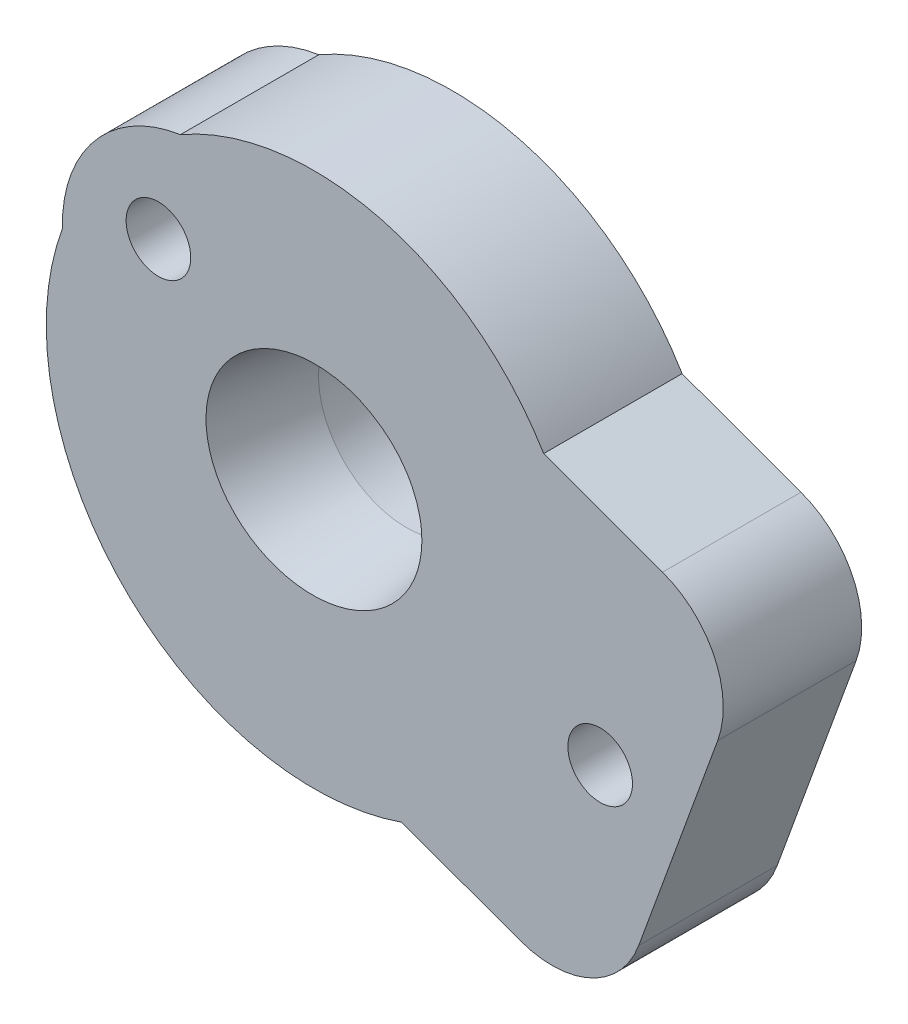
ISO-10303-21;
HEADER;
FILE_DESCRIPTION(('STEP AP214'),'2;1');
FILE_NAME('part.step','',(''),(''),'','','');
FILE_SCHEMA(('AUTOMOTIVE_DESIGN { 1 0 10303 214 1 1 1 1 }'));
ENDSEC;
DATA;
#1=APPLICATION_CONTEXT('core data for automotive mechanical design processes');
#2=APPLICATION_PROTOCOL_DEFINITION('international standard','automotive_design',2000,#1);
#3=PRODUCT_CONTEXT('',#1,'mechanical');
#4=PRODUCT('Part','Part','',(#3));
#5=PRODUCT_RELATED_PRODUCT_CATEGORY('part','',(#4));
#6=PRODUCT_DEFINITION_FORMATION('','',#4);
#7=PRODUCT_DEFINITION_CONTEXT('part definition',#1,'design');
#8=PRODUCT_DEFINITION('design','',#6,#7);
#9=PRODUCT_DEFINITION_SHAPE('','',#8);
#10=(LENGTH_UNIT() NAMED_UNIT(*) SI_UNIT(.MILLI.,.METRE.));
#11=(NAMED_UNIT(*) PLANE_ANGLE_UNIT() SI_UNIT($,.RADIAN.));
#12=(NAMED_UNIT(*) SI_UNIT($,.STERADIAN.) SOLID_ANGLE_UNIT());
#13=UNCERTAINTY_MEASURE_WITH_UNIT(LENGTH_MEASURE(1.E-05),#10,'distance_accuracy_value','');
#14=(GEOMETRIC_REPRESENTATION_CONTEXT(3) GLOBAL_UNCERTAINTY_ASSIGNED_CONTEXT((#13)) GLOBAL_UNIT_ASSIGNED_CONTEXT((#10,
#11,#12)) REPRESENTATION_CONTEXT('',''));
#15=CARTESIAN_POINT('',(0.,0.,0.));
#16=DIRECTION('',(0.,0.,1.));
#17=DIRECTION('',(1.,0.,0.));
#18=AXIS2_PLACEMENT_3D('',#15,#16,#17);
#19=CARTESIAN_POINT('',(0.,0.,10.));
#20=DIRECTION('',(0.,0.,-1.));
#21=DIRECTION('',(-1.,0.,0.));
#22=AXIS2_PLACEMENT_3D('',#19,#20,#21);
#23=CYLINDRICAL_SURFACE('',#22,29.);
#24=CARTESIAN_POINT('',(0.,0.,10.));
#25=DIRECTION('',(0.,0.,1.));
#26=DIRECTION('',(1.,0.,0.));
#27=AXIS2_PLACEMENT_3D('',#24,#25,#26);
#28=CIRCLE('',#27,29.);
#29=CARTESIAN_POINT('',(-27.2510860027963,9.91858415643088,10.));
#30=VERTEX_POINT('',#29);
#31=CARTESIAN_POINT('',(9.4973269071652,-27.4007441800115,10.));
#32=VERTEX_POINT('',#31);
#33=EDGE_CURVE('E153',#30,#32,#28,.T.);
#34=ORIENTED_EDGE('',*,*,#33,.F.);
#35=DIRECTION('',(0.,0.,1.));
#36=VECTOR('',#35,1.);
#37=CARTESIAN_POINT('',(-27.2510860027963,9.91858415643088,-5.));
#38=LINE('',#37,#36);
#39=CARTESIAN_POINT('',(-27.2510860027963,9.91858415643088,-5.));
#40=VERTEX_POINT('',#39);
#41=EDGE_CURVE('E211',#40,#30,#38,.T.);
#42=ORIENTED_EDGE('',*,*,#41,.F.);
#43=CARTESIAN_POINT('',(0.,0.,-5.));
#44=DIRECTION('',(0.,0.,1.));
#45=DIRECTION('',(1.,0.,0.));
#46=AXIS2_PLACEMENT_3D('',#43,#44,#45);
#47=CIRCLE('',#46,29.);
#48=CARTESIAN_POINT('',(9.4973269071652,-27.4007441800115,-5.));
#49=VERTEX_POINT('',#48);
#50=EDGE_CURVE('E222',#40,#49,#47,.T.);
#51=ORIENTED_EDGE('',*,*,#50,.T.);
#52=DIRECTION('',(0.,0.,-1.));
#53=VECTOR('',#52,1.);
#54=CARTESIAN_POINT('',(9.49732690716522,-27.4007441800115,10.));
#55=LINE('',#54,#53);
#56=EDGE_CURVE('E236',#49,#32,#55,.F.);
#57=ORIENTED_EDGE('',*,*,#56,.T.);
#58=EDGE_LOOP('',(#34,#42,#51,#57));
#59=FACE_BOUND('',#58,.T.);
#60=ADVANCED_FACE('F143',(#59),#23,.T.);
#61=CARTESIAN_POINT('',(24.88823335682,14.8854237553544,-5.));
#62=VERTEX_POINT('',#61);
#63=CARTESIAN_POINT('',(-14.4705437140708,25.1317202876995,-5.));
#64=VERTEX_POINT('',#63);
#65=EDGE_CURVE('E231',#62,#64,#47,.T.);
#66=ORIENTED_EDGE('',*,*,#65,.T.);
#67=DIRECTION('',(0.,0.,1.));
#68=VECTOR('',#67,1.);
#69=CARTESIAN_POINT('',(-14.4705437140708,25.1317202876995,-5.));
#70=LINE('',#69,#68);
#71=CARTESIAN_POINT('',(-14.4705437140708,25.1317202876995,10.));
#72=VERTEX_POINT('',#71);
#73=EDGE_CURVE('E214',#64,#72,#70,.T.);
#74=ORIENTED_EDGE('',*,*,#73,.T.);
#75=CARTESIAN_POINT('',(24.88823335682,14.8854237553545,10.));
#76=VERTEX_POINT('',#75);
#77=EDGE_CURVE('E13',#76,#72,#28,.T.);
#78=ORIENTED_EDGE('',*,*,#77,.F.);
#79=DIRECTION('',(0.,0.,-1.));
#80=VECTOR('',#79,1.);
#81=CARTESIAN_POINT('',(24.88823335682,14.8854237553544,10.));
#82=LINE('',#81,#80);
#83=EDGE_CURVE('E309',#62,#76,#82,.F.);
#84=ORIENTED_EDGE('',*,*,#83,.F.);
#85=EDGE_LOOP('',(#66,#74,#78,#84));
#86=FACE_BOUND('',#85,.T.);
#87=ADVANCED_FACE('F145',(#86),#23,.T.);
#88=CARTESIAN_POINT('',(0.,0.,10.));
#89=DIRECTION('',(0.,0.,1.));
#90=DIRECTION('',(1.,0.,0.));
#91=AXIS2_PLACEMENT_3D('',#88,#89,#90);
#92=PLANE('',#91);
#93=ORIENTED_EDGE('',*,*,#77,.T.);
#94=CARTESIAN_POINT('',(-12.2352670019781,10.2788370513048,10.));
#95=DIRECTION('',(0.,0.,1.));
#96=DIRECTION('',(1.,0.,0.));
#97=AXIS2_PLACEMENT_3D('',#94,#95,#96);
#98=CIRCLE('',#97,15.0201398932766);
#99=EDGE_CURVE('E160',#72,#30,#98,.T.);
#100=ORIENTED_EDGE('',*,*,#99,.T.);
#101=ORIENTED_EDGE('',*,*,#33,.T.);
#102=DIRECTION('',(-0.939692620785911,0.342020143325663,0.));
#103=VECTOR('',#102,1.);
#104=CARTESIAN_POINT('',(22.3747106403217,-32.0877285541042,10.));
#105=LINE('',#104,#103);
#106=CARTESIAN_POINT('',(22.3747106403217,-32.0877285541042,10.));
#107=VERTEX_POINT('',#106);
#108=EDGE_CURVE('E318',#107,#32,#105,.T.);
#109=ORIENTED_EDGE('',*,*,#108,.F.);
#110=CARTESIAN_POINT('',(25.7949120735784,-22.6908023462451,10.));
#111=DIRECTION('',(0.,0.,1.));
#112=DIRECTION('',(1.,0.,0.));
#113=AXIS2_PLACEMENT_3D('',#110,#111,#112);
#114=CIRCLE('',#113,10.);
#115=CARTESIAN_POINT('',(35.1918382814375,-26.1110037795017,10.));
#116=VERTEX_POINT('',#115);
#117=EDGE_CURVE('E321',#116,#107,#114,.F.);
#118=ORIENTED_EDGE('',*,*,#117,.F.);
#119=DIRECTION('',(0.342020143325663,0.939692620785911,0.));
#120=VECTOR('',#119,1.);
#121=CARTESIAN_POINT('',(35.1918382814375,-26.1110037795017,10.));
#122=LINE('',#121,#120);
#123=CARTESIAN_POINT('',(43.742341864579,-2.61868825985399,10.));
#124=VERTEX_POINT('',#123);
#125=EDGE_CURVE('E326',#116,#124,#122,.T.);
#126=ORIENTED_EDGE('',*,*,#125,.T.);
#127=CARTESIAN_POINT('',(34.3454156567199,0.80151317340266,10.));
#128=DIRECTION('',(0.,0.,1.));
#129=DIRECTION('',(1.,0.,0.));
#130=AXIS2_PLACEMENT_3D('',#127,#128,#129);
#131=CIRCLE('',#130,10.);
#132=CARTESIAN_POINT('',(37.7656170899766,10.1984393812618,10.));
#133=VERTEX_POINT('',#132);
#134=EDGE_CURVE('E312',#124,#133,#131,.T.);
#135=ORIENTED_EDGE('',*,*,#134,.T.);
#136=DIRECTION('',(-0.939692620785911,0.342020143325663,0.));
#137=VECTOR('',#136,1.);
#138=CARTESIAN_POINT('',(37.7656170899766,10.1984393812618,10.));
#139=LINE('',#138,#137);
#140=EDGE_CURVE('E166',#133,#76,#139,.T.);
#141=ORIENTED_EDGE('',*,*,#140,.T.);
#142=EDGE_LOOP('',(#93,#100,#101,#109,#118,#126,#135,#141));
#143=FACE_BOUND('',#142,.T.);
#144=CARTESIAN_POINT('',(-16.8529777486086,14.1413274131145,10.));
#145=DIRECTION('',(0.,0.,1.));
#146=DIRECTION('',(1.,0.,0.));
#147=AXIS2_PLACEMENT_3D('',#144,#145,#146);
#148=CIRCLE('',#147,3.5);
#149=CARTESIAN_POINT('',(-13.3529777486086,14.1413274131145,10.));
#150=VERTEX_POINT('',#149);
#151=EDGE_CURVE('E322',#150,#150,#148,.T.);
#152=ORIENTED_EDGE('',*,*,#151,.F.);
#153=EDGE_LOOP('',(#152));
#154=FACE_BOUND('',#153,.T.);
#155=CARTESIAN_POINT('',(0.,0.,10.));
#156=DIRECTION('',(0.,0.,1.));
#157=DIRECTION('',(0.996194698091745,0.0871557427476656,0.));
#158=AXIS2_PLACEMENT_3D('',#155,#156,#157);
#159=ELLIPSE('',#158,11.7,10.9);
#160=CARTESIAN_POINT('',(11.6554779676734,1.01972219014769,10.));
#161=VERTEX_POINT('',#160);
#162=EDGE_CURVE('E295',#161,#161,#159,.T.);
#163=ORIENTED_EDGE('',*,*,#162,.F.);
#164=EDGE_LOOP('',(#163));
#165=FACE_BOUND('',#164,.T.);
#166=CARTESIAN_POINT('',(31.009856485935,-11.2866647297469,10.));
#167=DIRECTION('',(0.,0.,1.));
#168=DIRECTION('',(1.,0.,0.));
#169=AXIS2_PLACEMENT_3D('',#166,#167,#168);
#170=CIRCLE('',#169,3.5);
#171=CARTESIAN_POINT('',(34.509856485935,-11.2866647297469,10.));
#172=VERTEX_POINT('',#171);
#173=EDGE_CURVE('E307',#172,#172,#170,.F.);
#174=ORIENTED_EDGE('',*,*,#173,.T.);
#175=EDGE_LOOP('',(#174));
#176=FACE_BOUND('',#175,.T.);
#177=ADVANCED_FACE('F272',(#143,#154,#165,#176),#92,.T.);
#178=CARTESIAN_POINT('',(0.82797955610265,-9.4638496318716,0.));
#179=CARTESIAN_POINT('',(0.848315896077142,-9.69629506142633,1.66666666666667));
#180=CARTESIAN_POINT('',(0.888988576026125,-10.1611859205358,5.));
#181=CARTESIAN_POINT('',(0.929661255975078,-10.6260767796453,8.33333333333334));
#182=CARTESIAN_POINT('',(0.949997595949554,-10.8585222092,10.));
#183=CARTESIAN_POINT('',(2.0667945661406,-9.35546736228754,0.));
#184=CARTESIAN_POINT('',(2.12792208834004,-9.58434402582576,1.66666666666667));
#185=CARTESIAN_POINT('',(2.25017713273893,-10.0420973529022,5.));
#186=CARTESIAN_POINT('',(2.36605710040764,-10.5004084269217,8.33333333333334));
#187=CARTESIAN_POINT('',(2.42399708424199,-10.7295639639314,10.));
#188=CARTESIAN_POINT('',(4.50089888047922,-8.64656557606986,0.));
#189=CARTESIAN_POINT('',(4.64350675930876,-8.86484387485121,1.66666666666666));
#190=CARTESIAN_POINT('',(4.92872251696785,-9.30140047241392,4.99999999999999));
#191=CARTESIAN_POINT('',(5.1939292748559,-9.73251379813695,8.33333333333334));
#192=CARTESIAN_POINT('',(5.32653265379993,-9.94807046099846,10.));
#193=CARTESIAN_POINT('',(7.46716345646486,-6.26550092433688,0.));
#194=CARTESIAN_POINT('',(7.73507009998541,-6.44343938202825,1.66666666666667));
#195=CARTESIAN_POINT('',(8.27088338702653,-6.79931629741098,5.00000000000002));
#196=CARTESIAN_POINT('',(8.7501401870744,-7.1369514054178,8.33333333333333));
#197=CARTESIAN_POINT('',(8.98976858709834,-7.30576895942121,9.99999999999998));
#198=CARTESIAN_POINT('',(9.29650319896245,-2.93123231543229,0.));
#199=CARTESIAN_POINT('',(9.66743128755973,-3.02182287384426,1.66666666666666));
#200=CARTESIAN_POINT('',(10.4092874647543,-3.20300399066821,4.99999999999999));
#201=CARTESIAN_POINT('',(11.0589275568529,-3.37289987928917,8.33333333333333));
#202=CARTESIAN_POINT('',(11.3837476029022,-3.45784782359964,10.));
#203=CARTESIAN_POINT('',(9.71057118739856,0.849564895258722,0.));
#204=CARTESIAN_POINT('',(10.1158578897645,0.885022887193555,1.66666666666667));
#205=CARTESIAN_POINT('',(10.9264312944965,0.95593887106322,5.00000000000001));
#206=CARTESIAN_POINT('',(11.6328464496746,1.01774218888427,8.33333333333334));
#207=CARTESIAN_POINT('',(11.9860540272637,1.0486438477948,10.));
#208=CARTESIAN_POINT('',(8.64626527634788,4.50102114929213,0.));
#209=CARTESIAN_POINT('',(8.9958272484264,4.65464642019637,1.66666666666666));
#210=CARTESIAN_POINT('',(9.69495119258344,4.96189696200486,4.99999999999999));
#211=CARTESIAN_POINT('',(10.3052196804976,5.24202056845598,8.33333333333333));
#212=CARTESIAN_POINT('',(10.6103539244546,5.38208237168153,10.));
#213=CARTESIAN_POINT('',(6.26572764725463,7.46697321334815,0.));
#214=CARTESIAN_POINT('',(6.49866549796217,7.68872988647386,1.66666666666667));
#215=CARTESIAN_POINT('',(6.96454119937725,8.13224323272529,5.00000000000002));
#216=CARTESIAN_POINT('',(7.37788729052637,8.54797097474241,8.33333333333332));
#217=CARTESIAN_POINT('',(7.58456033610093,8.75583484575096,9.99999999999997));
#218=CARTESIAN_POINT('',(2.93105975765796,9.29677770470038,0.));
#219=CARTESIAN_POINT('',(3.03359747356226,9.53650346393429,1.66666666666666));
#220=CARTESIAN_POINT('',(3.23867290537087,10.0159549824021,4.99999999999999));
#221=CARTESIAN_POINT('',(3.42498853331052,10.4865713982132,8.33333333333334));
#222=CARTESIAN_POINT('',(3.51814634728035,10.7218796061188,10.));
#223=CARTESIAN_POINT('',(0.410835453935297,9.57223190145566,0.));
#224=CARTESIAN_POINT('',(0.4312902961858,9.8082460970269,1.66666666666667));
#225=CARTESIAN_POINT('',(0.472199980686806,10.2802744881694,5.));
#226=CARTESIAN_POINT('',(0.506734588457658,10.7517451323689,8.33333333333334));
#227=CARTESIAN_POINT('',(0.524001892343083,10.9874804544686,10.));
#228=CARTESIAN_POINT('',(-2.06679456614061,9.35546736228753,0.));
#229=CARTESIAN_POINT('',(-2.12792208834001,9.58434402582577,1.66666666666667));
#230=CARTESIAN_POINT('',(-2.25017713273881,10.0420973529022,5.));
#231=CARTESIAN_POINT('',(-2.36605710040748,10.5004084269217,8.33333333333333));
#232=CARTESIAN_POINT('',(-2.42399708424181,10.7295639639314,10.));
#233=CARTESIAN_POINT('',(-4.50089888047922,8.64656557606986,0.));
#234=CARTESIAN_POINT('',(-4.64350675930873,8.86484387485123,1.66666666666667));
#235=CARTESIAN_POINT('',(-4.92872251696775,9.30140047241397,5.));
#236=CARTESIAN_POINT('',(-5.19392927485576,9.73251379813701,8.33333333333331));
#237=CARTESIAN_POINT('',(-5.32653265379977,9.94807046099852,9.99999999999997));
#238=CARTESIAN_POINT('',(-7.46716345646489,6.26550092433686,0.));
#239=CARTESIAN_POINT('',(-7.73507009998542,6.44343938202825,1.66666666666667));
#240=CARTESIAN_POINT('',(-8.27088338702649,6.79931629741101,5.00000000000001));
#241=CARTESIAN_POINT('',(-8.75014018707435,7.13695140541789,8.33333333333335));
#242=CARTESIAN_POINT('',(-8.98976858709828,7.30576895942132,10.));
#243=CARTESIAN_POINT('',(-9.29650319896246,2.93123231543228,0.));
#244=CARTESIAN_POINT('',(-9.66743128755973,3.02182287384428,1.66666666666667));
#245=CARTESIAN_POINT('',(-10.4092874647543,3.20300399066826,5.));
#246=CARTESIAN_POINT('',(-11.0589275568529,3.37289987928922,8.33333333333331));
#247=CARTESIAN_POINT('',(-11.3837476029022,3.45784782359969,9.99999999999997));
#248=CARTESIAN_POINT('',(-9.71057118739855,-0.849564895258744,0.));
#249=CARTESIAN_POINT('',(-10.1158578897645,-0.885022887193575,1.66666666666667));
#250=CARTESIAN_POINT('',(-10.9264312944965,-0.955938871063238,5.00000000000001));
#251=CARTESIAN_POINT('',(-11.6328464496746,-1.01774218888426,8.33333333333336));
#252=CARTESIAN_POINT('',(-11.9860540272637,-1.04864384779477,10.));
#253=CARTESIAN_POINT('',(-8.64626527634789,-4.50102114929208,0.));
#254=CARTESIAN_POINT('',(-8.99582724842641,-4.65464642019636,1.66666666666666));
#255=CARTESIAN_POINT('',(-9.69495119258344,-4.96189696200491,4.99999999999998));
#256=CARTESIAN_POINT('',(-10.3052196804975,-5.24202056845605,8.33333333333333));
#257=CARTESIAN_POINT('',(-10.6103539244546,-5.38208237168161,9.99999999999999));
#258=CARTESIAN_POINT('',(-6.26572764725465,-7.46697321334818,0.));
#259=CARTESIAN_POINT('',(-6.49866549796215,-7.68872988647389,1.66666666666667));
#260=CARTESIAN_POINT('',(-6.96454119937714,-8.13224323272532,5.00000000000002));
#261=CARTESIAN_POINT('',(-7.37788729052629,-8.54797097474247,8.33333333333334));
#262=CARTESIAN_POINT('',(-7.58456033610087,-8.75583484575104,9.99999999999999));
#263=CARTESIAN_POINT('',(-2.93105975765798,-9.29677770470035,0.));
#264=CARTESIAN_POINT('',(-3.03359747356226,-9.53650346393428,1.66666666666667));
#265=CARTESIAN_POINT('',(-3.23867290537083,-10.0159549824021,5.));
#266=CARTESIAN_POINT('',(-3.42498853331037,-10.4865713982133,8.33333333333333));
#267=CARTESIAN_POINT('',(-3.51814634728015,-10.7218796061188,10.));
#268=CARTESIAN_POINT('',(-0.410835453935306,-9.57223190145566,0.));
#269=CARTESIAN_POINT('',(-0.431290296185767,-9.8082460970269,1.66666666666667));
#270=CARTESIAN_POINT('',(-0.472199980686687,-10.2802744881694,5.));
#271=CARTESIAN_POINT('',(-0.506734588457493,-10.7517451323689,8.33333333333334));
#272=CARTESIAN_POINT('',(-0.524001892342896,-10.9874804544686,10.));
#273=CARTESIAN_POINT('',(0.82797955610265,-9.4638496318716,0.));
#274=CARTESIAN_POINT('',(0.848315896077142,-9.69629506142633,1.66666666666667));
#275=CARTESIAN_POINT('',(0.888988576026125,-10.1611859205358,5.));
#276=CARTESIAN_POINT('',(0.929661255975078,-10.6260767796453,8.33333333333334));
#277=CARTESIAN_POINT('',(0.949997595949554,-10.8585222092,10.));
#278=B_SPLINE_SURFACE_WITH_KNOTS('',3,3,((#178,#179,#180,#181,#182),(#183,#184,#185,#186,#187),
(#188,#189,#190,#191,#192),(#193,#194,#195,#196,#197),(#198,#199,#200,#201,#202),(#203,#204,
#205,#206,#207),(#208,#209,#210,#211,#212),(#213,#214,#215,#216,#217),(#218,#219,#220,#221,
#222),(#223,#224,#225,#226,#227),(#228,#229,#230,#231,#232),(#233,#234,#235,#236,#237),(#238,
#239,#240,#241,#242),(#243,#244,#245,#246,#247),(#248,#249,#250,#251,#252),(#253,#254,#255,#256,
#257),(#258,#259,#260,#261,#262),(#263,#264,#265,#266,#267),(#268,#269,#270,#271,#272),(#273,
#274,#275,#276,#277)),.UNSPECIFIED.,.T.,.F.,.F.,(4,1,1,1,1,1,1,1,2,1,1,1,1,1,1,1,4),(4,1,4),(0.,
0.0624999999999998,0.125,0.1875,0.249999999999999,0.312499999999999,0.374999999999999,
0.437499999999999,0.499999999999999,0.562499999999999,0.624999999999999,0.687499999999999,
0.749999999999999,0.8125,0.875,0.9375,1.),(0.,0.5,1.),.UNSPECIFIED.);
#279=CARTESIAN_POINT('',(0.,0.,0.));
#280=DIRECTION('',(0.,0.,1.));
#281=DIRECTION('',(0.996194698091745,0.0871557427476652,0.));
#282=AXIS2_PLACEMENT_3D('',#279,#280,#281);
#283=ELLIPSE('',#282,9.50000000000001,9.50000000000001);
#284=CARTESIAN_POINT('',(9.46384963187158,0.82797955610282,0.));
#285=VERTEX_POINT('',#284);
#286=EDGE_CURVE('E234',#285,#285,#283,.T.);
#287=ORIENTED_EDGE('',*,*,#286,.F.);
#288=EDGE_LOOP('',(#287));
#289=FACE_BOUND('',#288,.T.);
#290=ORIENTED_EDGE('',*,*,#162,.T.);
#291=EDGE_LOOP('',(#290));
#292=FACE_BOUND('',#291,.T.);
#293=ADVANCED_FACE('F266',(#289,#292),#278,.F.);
#294=CARTESIAN_POINT('',(0.,0.,-5.));
#295=DIRECTION('',(0.,0.,1.));
#296=DIRECTION('',(1.,0.,0.));
#297=AXIS2_PLACEMENT_3D('',#294,#295,#296);
#298=PLANE('',#297);
#299=CARTESIAN_POINT('',(-16.8529777486086,14.1413274131145,-5.));
#300=DIRECTION('',(0.,0.,-1.));
#301=DIRECTION('',(-1.,0.,0.));
#302=AXIS2_PLACEMENT_3D('',#299,#300,#301);
#303=CIRCLE('',#302,3.5);
#304=CARTESIAN_POINT('',(-20.3529777486086,14.1413274131145,-5.));
#305=VERTEX_POINT('',#304);
#306=EDGE_CURVE('E364',#305,#305,#303,.T.);
#307=ORIENTED_EDGE('',*,*,#306,.F.);
#308=EDGE_LOOP('',(#307));
#309=FACE_BOUND('',#308,.T.);
#310=ORIENTED_EDGE('',*,*,#50,.F.);
#311=CARTESIAN_POINT('',(-12.2352670019781,10.2788370513048,-5.));
#312=DIRECTION('',(0.,0.,1.));
#313=DIRECTION('',(1.,0.,0.));
#314=AXIS2_PLACEMENT_3D('',#311,#312,#313);
#315=CIRCLE('',#314,15.0201398932766);
#316=EDGE_CURVE('E208',#64,#40,#315,.T.);
#317=ORIENTED_EDGE('',*,*,#316,.F.);
#318=ORIENTED_EDGE('',*,*,#65,.F.);
#319=DIRECTION('',(-0.93969262078591,0.342020143325663,0.));
#320=VECTOR('',#319,1.);
#321=CARTESIAN_POINT('',(37.7656170899766,10.1984393812618,-5.));
#322=LINE('',#321,#320);
#323=CARTESIAN_POINT('',(37.7656170899766,10.1984393812618,-5.));
#324=VERTEX_POINT('',#323);
#325=EDGE_CURVE('E338',#324,#62,#322,.T.);
#326=ORIENTED_EDGE('',*,*,#325,.F.);
#327=CARTESIAN_POINT('',(34.3454156567199,0.80151317340266,-5.));
#328=DIRECTION('',(0.,0.,1.));
#329=DIRECTION('',(1.,0.,0.));
#330=AXIS2_PLACEMENT_3D('',#327,#328,#329);
#331=CIRCLE('',#330,10.);
#332=CARTESIAN_POINT('',(43.742341864579,-2.61868825985399,-5.));
#333=VERTEX_POINT('',#332);
#334=EDGE_CURVE('E336',#333,#324,#331,.T.);
#335=ORIENTED_EDGE('',*,*,#334,.F.);
#336=DIRECTION('',(0.342020143325663,0.939692620785911,0.));
#337=VECTOR('',#336,1.);
#338=CARTESIAN_POINT('',(35.1918382814375,-26.1110037795017,-5.));
#339=LINE('',#338,#337);
#340=CARTESIAN_POINT('',(35.1918382814375,-26.1110037795017,-5.));
#341=VERTEX_POINT('',#340);
#342=EDGE_CURVE('E333',#341,#333,#339,.T.);
#343=ORIENTED_EDGE('',*,*,#342,.F.);
#344=CARTESIAN_POINT('',(25.7949120735784,-22.6908023462451,-5.));
#345=DIRECTION('',(0.,0.,-1.));
#346=DIRECTION('',(-1.,0.,0.));
#347=AXIS2_PLACEMENT_3D('',#344,#345,#346);
#348=CIRCLE('',#347,10.);
#349=CARTESIAN_POINT('',(22.3747106403217,-32.0877285541042,-5.));
#350=VERTEX_POINT('',#349);
#351=EDGE_CURVE('E328',#341,#350,#348,.T.);
#352=ORIENTED_EDGE('',*,*,#351,.T.);
#353=DIRECTION('',(-0.939692620785911,0.342020143325663,0.));
#354=VECTOR('',#353,1.);
#355=CARTESIAN_POINT('',(22.3747106403217,-32.0877285541042,-5.));
#356=LINE('',#355,#354);
#357=EDGE_CURVE('E230',#350,#49,#356,.T.);
#358=ORIENTED_EDGE('',*,*,#357,.T.);
#359=EDGE_LOOP('',(#310,#317,#318,#326,#335,#343,#352,#358));
#360=FACE_BOUND('',#359,.T.);
#361=CARTESIAN_POINT('',(0.,0.,-5.));
#362=DIRECTION('',(0.,0.,1.));
#363=DIRECTION('',(0.996194698091745,0.0871557427476652,0.));
#364=AXIS2_PLACEMENT_3D('',#361,#362,#363);
#365=ELLIPSE('',#364,9.50000000000001,9.50000000000001);
#366=CARTESIAN_POINT('',(9.46384963187158,0.82797955610282,-5.));
#367=VERTEX_POINT('',#366);
#368=EDGE_CURVE('E232',#367,#367,#365,.T.);
#369=ORIENTED_EDGE('',*,*,#368,.T.);
#370=EDGE_LOOP('',(#369));
#371=FACE_BOUND('',#370,.T.);
#372=CARTESIAN_POINT('',(31.009856485935,-11.2866647297469,-5.));
#373=DIRECTION('',(0.,0.,-1.));
#374=DIRECTION('',(-1.,0.,0.));
#375=AXIS2_PLACEMENT_3D('',#372,#373,#374);
#376=CIRCLE('',#375,3.5);
#377=CARTESIAN_POINT('',(27.509856485935,-11.2866647297469,-5.));
#378=VERTEX_POINT('',#377);
#379=EDGE_CURVE('E316',#378,#378,#376,.T.);
#380=ORIENTED_EDGE('',*,*,#379,.F.);
#381=EDGE_LOOP('',(#380));
#382=FACE_BOUND('',#381,.T.);
#383=ADVANCED_FACE('F226',(#309,#360,#371,#382),#298,.F.);
#384=DIRECTION('',(0.,0.,1.));
#385=VECTOR('',#384,1.);
#386=SURFACE_OF_LINEAR_EXTRUSION('',#365,#385);
#387=ORIENTED_EDGE('',*,*,#368,.F.);
#388=EDGE_LOOP('',(#387));
#389=FACE_BOUND('',#388,.T.);
#390=ORIENTED_EDGE('',*,*,#286,.T.);
#391=EDGE_LOOP('',(#390));
#392=FACE_BOUND('',#391,.T.);
#393=ADVANCED_FACE('F250',(#389,#392),#386,.F.);
#394=CARTESIAN_POINT('',(22.3747106403217,-32.0877285541042,69.0388031764485));
#395=DIRECTION('',(-0.342020143325663,-0.93969262078591,0.));
#396=DIRECTION('',(0.939692620785911,-0.342020143325663,0.));
#397=AXIS2_PLACEMENT_3D('',#394,#395,#396);
#398=PLANE('',#397);
#399=ORIENTED_EDGE('',*,*,#56,.F.);
#400=ORIENTED_EDGE('',*,*,#357,.F.);
#401=DIRECTION('',(0.,0.,-1.));
#402=VECTOR('',#401,1.);
#403=CARTESIAN_POINT('',(22.3747106403217,-32.0877285541042,69.0388031764485));
#404=LINE('',#403,#402);
#405=EDGE_CURVE('E325',#107,#350,#404,.T.);
#406=ORIENTED_EDGE('',*,*,#405,.F.);
#407=ORIENTED_EDGE('',*,*,#108,.T.);
#408=EDGE_LOOP('',(#399,#400,#406,#407));
#409=FACE_BOUND('',#408,.T.);
#410=ADVANCED_FACE('F260',(#409),#398,.T.);
#411=CARTESIAN_POINT('',(37.7656170899766,10.1984393812618,69.0388031764485));
#412=DIRECTION('',(-0.342020143325663,-0.93969262078591,0.));
#413=DIRECTION('',(0.939692620785911,-0.342020143325663,0.));
#414=AXIS2_PLACEMENT_3D('',#411,#412,#413);
#415=PLANE('',#414);
#416=ORIENTED_EDGE('',*,*,#325,.T.);
#417=ORIENTED_EDGE('',*,*,#83,.T.);
#418=ORIENTED_EDGE('',*,*,#140,.F.);
#419=DIRECTION('',(0.,0.,-1.));
#420=VECTOR('',#419,1.);
#421=CARTESIAN_POINT('',(37.7656170899766,10.1984393812618,69.0388031764485));
#422=LINE('',#421,#420);
#423=EDGE_CURVE('E337',#133,#324,#422,.T.);
#424=ORIENTED_EDGE('',*,*,#423,.T.);
#425=EDGE_LOOP('',(#416,#417,#418,#424));
#426=FACE_BOUND('',#425,.T.);
#427=ADVANCED_FACE('F360',(#426),#415,.F.);
#428=CARTESIAN_POINT('',(25.7949120735784,-22.6908023462451,69.0388031764485));
#429=DIRECTION('',(0.,0.,-1.));
#430=DIRECTION('',(-1.,0.,0.));
#431=AXIS2_PLACEMENT_3D('',#428,#429,#430);
#432=CYLINDRICAL_SURFACE('',#431,10.);
#433=DIRECTION('',(0.,0.,-1.));
#434=VECTOR('',#433,1.);
#435=CARTESIAN_POINT('',(35.1918382814375,-26.1110037795017,69.0388031764485));
#436=LINE('',#435,#434);
#437=EDGE_CURVE('E331',#116,#341,#436,.T.);
#438=ORIENTED_EDGE('',*,*,#437,.F.);
#439=ORIENTED_EDGE('',*,*,#117,.T.);
#440=ORIENTED_EDGE('',*,*,#405,.T.);
#441=ORIENTED_EDGE('',*,*,#351,.F.);
#442=EDGE_LOOP('',(#438,#439,#440,#441));
#443=FACE_BOUND('',#442,.T.);
#444=ADVANCED_FACE('F347',(#443),#432,.T.);
#445=CARTESIAN_POINT('',(35.1918382814375,-26.1110037795017,69.0388031764485));
#446=DIRECTION('',(-0.939692620785911,0.342020143325663,0.));
#447=DIRECTION('',(-0.342020143325663,-0.939692620785911,0.));
#448=AXIS2_PLACEMENT_3D('',#445,#446,#447);
#449=PLANE('',#448);
#450=ORIENTED_EDGE('',*,*,#125,.F.);
#451=ORIENTED_EDGE('',*,*,#437,.T.);
#452=ORIENTED_EDGE('',*,*,#342,.T.);
#453=DIRECTION('',(0.,0.,-1.));
#454=VECTOR('',#453,1.);
#455=CARTESIAN_POINT('',(43.742341864579,-2.61868825985399,69.0388031764485));
#456=LINE('',#455,#454);
#457=EDGE_CURVE('E334',#124,#333,#456,.T.);
#458=ORIENTED_EDGE('',*,*,#457,.F.);
#459=EDGE_LOOP('',(#450,#451,#452,#458));
#460=FACE_BOUND('',#459,.T.);
#461=ADVANCED_FACE('F351',(#460),#449,.F.);
#462=CARTESIAN_POINT('',(34.3454156567199,0.80151317340266,69.0388031764485));
#463=DIRECTION('',(0.,0.,-1.));
#464=DIRECTION('',(-1.,0.,0.));
#465=AXIS2_PLACEMENT_3D('',#462,#463,#464);
#466=CYLINDRICAL_SURFACE('',#465,10.);
#467=ORIENTED_EDGE('',*,*,#134,.F.);
#468=ORIENTED_EDGE('',*,*,#457,.T.);
#469=ORIENTED_EDGE('',*,*,#334,.T.);
#470=ORIENTED_EDGE('',*,*,#423,.F.);
#471=EDGE_LOOP('',(#467,#468,#469,#470));
#472=FACE_BOUND('',#471,.T.);
#473=ADVANCED_FACE('F357',(#472),#466,.T.);
#474=CARTESIAN_POINT('',(31.009856485935,-11.2866647297469,69.0388031764485));
#475=DIRECTION('',(0.,0.,-1.));
#476=DIRECTION('',(-1.,0.,0.));
#477=AXIS2_PLACEMENT_3D('',#474,#475,#476);
#478=CYLINDRICAL_SURFACE('',#477,3.5);
#479=ORIENTED_EDGE('',*,*,#379,.T.);
#480=EDGE_LOOP('',(#479));
#481=FACE_BOUND('',#480,.T.);
#482=ORIENTED_EDGE('',*,*,#173,.F.);
#483=EDGE_LOOP('',(#482));
#484=FACE_BOUND('',#483,.T.);
#485=ADVANCED_FACE('F262',(#481,#484),#478,.F.);
#486=CARTESIAN_POINT('',(-16.8529777486086,14.1413274131145,10.0113971829949));
#487=DIRECTION('',(0.,0.,-1.));
#488=DIRECTION('',(-1.,0.,0.));
#489=AXIS2_PLACEMENT_3D('',#486,#487,#488);
#490=CYLINDRICAL_SURFACE('',#489,3.5);
#491=ORIENTED_EDGE('',*,*,#151,.T.);
#492=EDGE_LOOP('',(#491));
#493=FACE_BOUND('',#492,.T.);
#494=ORIENTED_EDGE('',*,*,#306,.T.);
#495=EDGE_LOOP('',(#494));
#496=FACE_BOUND('',#495,.T.);
#497=ADVANCED_FACE('F380',(#493,#496),#490,.F.);
#498=CARTESIAN_POINT('',(-12.2352670019781,10.2788370513048,-5.));
#499=DIRECTION('',(0.,0.,1.));
#500=DIRECTION('',(1.,0.,0.));
#501=AXIS2_PLACEMENT_3D('',#498,#499,#500);
#502=CYLINDRICAL_SURFACE('',#501,15.0201398932766);
#503=ORIENTED_EDGE('',*,*,#99,.F.);
#504=ORIENTED_EDGE('',*,*,#73,.F.);
#505=ORIENTED_EDGE('',*,*,#316,.T.);
#506=ORIENTED_EDGE('',*,*,#41,.T.);
#507=EDGE_LOOP('',(#503,#504,#505,#506));
#508=FACE_BOUND('',#507,.T.);
#509=ADVANCED_FACE('F210',(#508),#502,.T.);
#510=CLOSED_SHELL('',(#60,#87,#177,#293,#383,#393,#410,#427,#444,#461,#473,#485,#497,#509));
#511=MANIFOLD_SOLID_BREP('B2',#510);
#512=ADVANCED_BREP_SHAPE_REPRESENTATION('',(#18,#511),#14);
#513=SHAPE_DEFINITION_REPRESENTATION(#9,#512);
ENDSEC;
END-ISO-10303-21;
